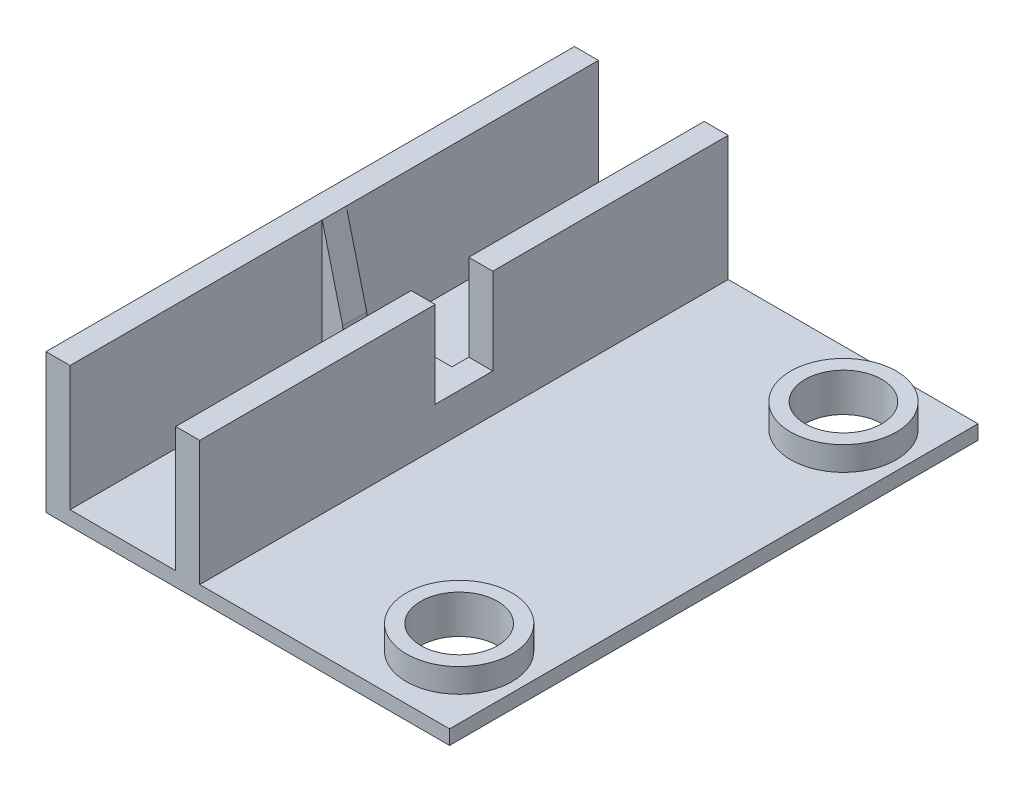
ISO-10303-21;
HEADER;
FILE_DESCRIPTION(('STEP AP214'),'2;1');
FILE_NAME('part.step','',(''),(''),'','','');
FILE_SCHEMA(('AUTOMOTIVE_DESIGN { 1 0 10303 214 1 1 1 1 }'));
ENDSEC;
DATA;
#1=APPLICATION_CONTEXT('core data for automotive mechanical design processes');
#2=APPLICATION_PROTOCOL_DEFINITION('international standard','automotive_design',2000,#1);
#3=PRODUCT_CONTEXT('',#1,'mechanical');
#4=PRODUCT('Part','Part','',(#3));
#5=PRODUCT_RELATED_PRODUCT_CATEGORY('part','',(#4));
#6=PRODUCT_DEFINITION_FORMATION('','',#4);
#7=PRODUCT_DEFINITION_CONTEXT('part definition',#1,'design');
#8=PRODUCT_DEFINITION('design','',#6,#7);
#9=PRODUCT_DEFINITION_SHAPE('','',#8);
#10=(LENGTH_UNIT() NAMED_UNIT(*) SI_UNIT(.MILLI.,.METRE.));
#11=(NAMED_UNIT(*) PLANE_ANGLE_UNIT() SI_UNIT($,.RADIAN.));
#12=(NAMED_UNIT(*) SI_UNIT($,.STERADIAN.) SOLID_ANGLE_UNIT());
#13=UNCERTAINTY_MEASURE_WITH_UNIT(LENGTH_MEASURE(1.E-05),#10,'distance_accuracy_value','');
#14=(GEOMETRIC_REPRESENTATION_CONTEXT(3) GLOBAL_UNCERTAINTY_ASSIGNED_CONTEXT((#13)) GLOBAL_UNIT_ASSIGNED_CONTEXT((#10,
#11,#12)) REPRESENTATION_CONTEXT('',''));
#15=CARTESIAN_POINT('',(0.,0.,0.));
#16=DIRECTION('',(0.,0.,1.));
#17=DIRECTION('',(1.,0.,0.));
#18=AXIS2_PLACEMENT_3D('',#15,#16,#17);
#19=CARTESIAN_POINT('',(-21.,14.5,48.1155281280883));
#20=DIRECTION('',(0.,-1.,0.));
#21=DIRECTION('',(0.,0.,-1.));
#22=AXIS2_PLACEMENT_3D('',#19,#20,#21);
#23=PLANE('',#22);
#24=DIRECTION('',(0.,0.,-1.));
#25=VECTOR('',#24,1.);
#26=CARTESIAN_POINT('',(-5.,14.5,48.1155281280883));
#27=LINE('',#26,#25);
#28=CARTESIAN_POINT('',(-5.,14.5,27.5));
#29=VERTEX_POINT('',#28);
#30=CARTESIAN_POINT('',(-5.,14.5,3.));
#31=VERTEX_POINT('',#30);
#32=EDGE_CURVE('E302',#29,#31,#27,.T.);
#33=ORIENTED_EDGE('',*,*,#32,.T.);
#34=DIRECTION('',(1.,0.,0.));
#35=VECTOR('',#34,1.);
#36=CARTESIAN_POINT('',(-11.5,14.5,3.));
#37=LINE('',#36,#35);
#38=CARTESIAN_POINT('',(-7.5,14.5,3.));
#39=VERTEX_POINT('',#38);
#40=EDGE_CURVE('E203',#39,#31,#37,.T.);
#41=ORIENTED_EDGE('',*,*,#40,.F.);
#42=DIRECTION('',(0.,0.,1.));
#43=VECTOR('',#42,1.);
#44=CARTESIAN_POINT('',(-7.5,14.5,-27.5));
#45=LINE('',#44,#43);
#46=CARTESIAN_POINT('',(-7.5,14.5,27.5));
#47=VERTEX_POINT('',#46);
#48=EDGE_CURVE('E281',#39,#47,#45,.T.);
#49=ORIENTED_EDGE('',*,*,#48,.T.);
#50=DIRECTION('',(1.,0.,0.));
#51=VECTOR('',#50,1.);
#52=CARTESIAN_POINT('',(-21.,14.5,27.5));
#53=LINE('',#52,#51);
#54=EDGE_CURVE('E306',#47,#29,#53,.T.);
#55=ORIENTED_EDGE('',*,*,#54,.T.);
#56=EDGE_LOOP('',(#33,#41,#49,#55));
#57=FACE_BOUND('',#56,.T.);
#58=ADVANCED_FACE('F47',(#57),#23,.F.);
#59=CARTESIAN_POINT('',(-7.5,14.5,-27.5));
#60=VERTEX_POINT('',#59);
#61=CARTESIAN_POINT('',(-7.5,14.5,-3.));
#62=VERTEX_POINT('',#61);
#63=EDGE_CURVE('E278',#60,#62,#45,.T.);
#64=ORIENTED_EDGE('',*,*,#63,.T.);
#65=DIRECTION('',(1.,0.,0.));
#66=VECTOR('',#65,1.);
#67=CARTESIAN_POINT('',(-11.5,14.5,-3.));
#68=LINE('',#67,#66);
#69=CARTESIAN_POINT('',(-5.,14.5,-3.));
#70=VERTEX_POINT('',#69);
#71=EDGE_CURVE('E216',#62,#70,#68,.T.);
#72=ORIENTED_EDGE('',*,*,#71,.T.);
#73=CARTESIAN_POINT('',(-5.,14.5,-27.5));
#74=VERTEX_POINT('',#73);
#75=EDGE_CURVE('E301',#70,#74,#27,.T.);
#76=ORIENTED_EDGE('',*,*,#75,.T.);
#77=DIRECTION('',(1.,0.,0.));
#78=VECTOR('',#77,1.);
#79=CARTESIAN_POINT('',(-21.,14.5,-27.5));
#80=LINE('',#79,#78);
#81=EDGE_CURVE('E290',#60,#74,#80,.T.);
#82=ORIENTED_EDGE('',*,*,#81,.F.);
#83=EDGE_LOOP('',(#64,#72,#76,#82));
#84=FACE_BOUND('',#83,.T.);
#85=ADVANCED_FACE('F429',(#84),#23,.F.);
#86=CARTESIAN_POINT('',(-18.5,14.5,-27.5));
#87=DIRECTION('',(-1.,0.,0.));
#88=DIRECTION('',(0.,0.,1.));
#89=AXIS2_PLACEMENT_3D('',#86,#87,#88);
#90=PLANE('',#89);
#91=DIRECTION('',(0.,1.,0.));
#92=VECTOR('',#91,1.);
#93=CARTESIAN_POINT('',(-18.5,14.5,-1.25));
#94=LINE('',#93,#92);
#95=CARTESIAN_POINT('',(-18.5,1.5,-1.25));
#96=VERTEX_POINT('',#95);
#97=CARTESIAN_POINT('',(-18.5,14.5,-1.25));
#98=VERTEX_POINT('',#97);
#99=EDGE_CURVE('E246',#96,#98,#94,.T.);
#100=ORIENTED_EDGE('',*,*,#99,.F.);
#101=DIRECTION('',(0.,0.,1.));
#102=VECTOR('',#101,1.);
#103=CARTESIAN_POINT('',(-18.5,1.5,-27.5));
#104=LINE('',#103,#102);
#105=CARTESIAN_POINT('',(-18.5,1.5,-27.5));
#106=VERTEX_POINT('',#105);
#107=EDGE_CURVE('E286',#106,#96,#104,.T.);
#108=ORIENTED_EDGE('',*,*,#107,.F.);
#109=DIRECTION('',(0.,-1.,0.));
#110=VECTOR('',#109,1.);
#111=CARTESIAN_POINT('',(-18.5,14.5,-27.5));
#112=LINE('',#111,#110);
#113=CARTESIAN_POINT('',(-18.5,14.5,-27.5));
#114=VERTEX_POINT('',#113);
#115=EDGE_CURVE('E255',#114,#106,#112,.T.);
#116=ORIENTED_EDGE('',*,*,#115,.F.);
#117=DIRECTION('',(0.,0.,1.));
#118=VECTOR('',#117,1.);
#119=CARTESIAN_POINT('',(-18.5,14.5,-27.5));
#120=LINE('',#119,#118);
#121=EDGE_CURVE('E273',#114,#98,#120,.T.);
#122=ORIENTED_EDGE('',*,*,#121,.T.);
#123=EDGE_LOOP('',(#100,#108,#116,#122));
#124=FACE_BOUND('',#123,.T.);
#125=ADVANCED_FACE('F434',(#124),#90,.F.);
#126=CARTESIAN_POINT('',(-7.5,14.5,-27.5));
#127=DIRECTION('',(1.,0.,0.));
#128=DIRECTION('',(0.,1.,0.));
#129=AXIS2_PLACEMENT_3D('',#126,#127,#128);
#130=PLANE('',#129);
#131=DIRECTION('',(0.,0.,-1.));
#132=VECTOR('',#131,1.);
#133=CARTESIAN_POINT('',(-7.5,5.5,-27.5));
#134=LINE('',#133,#132);
#135=CARTESIAN_POINT('',(-7.5,5.5,-1.25));
#136=VERTEX_POINT('',#135);
#137=CARTESIAN_POINT('',(-7.5,5.5,-3.));
#138=VERTEX_POINT('',#137);
#139=EDGE_CURVE('E224',#136,#138,#134,.T.);
#140=ORIENTED_EDGE('',*,*,#139,.T.);
#141=DIRECTION('',(0.,1.,0.));
#142=VECTOR('',#141,1.);
#143=CARTESIAN_POINT('',(-7.5,14.5,-3.));
#144=LINE('',#143,#142);
#145=EDGE_CURVE('E227',#138,#62,#144,.T.);
#146=ORIENTED_EDGE('',*,*,#145,.T.);
#147=ORIENTED_EDGE('',*,*,#63,.F.);
#148=DIRECTION('',(0.,1.,0.));
#149=VECTOR('',#148,1.);
#150=CARTESIAN_POINT('',(-7.5,14.5,-27.5));
#151=LINE('',#150,#149);
#152=CARTESIAN_POINT('',(-7.5,1.5,-27.5));
#153=VERTEX_POINT('',#152);
#154=EDGE_CURVE('E262',#153,#60,#151,.T.);
#155=ORIENTED_EDGE('',*,*,#154,.F.);
#156=DIRECTION('',(0.,0.,1.));
#157=VECTOR('',#156,1.);
#158=CARTESIAN_POINT('',(-7.5,1.5,-27.5));
#159=LINE('',#158,#157);
#160=CARTESIAN_POINT('',(-7.5,1.5,-1.25));
#161=VERTEX_POINT('',#160);
#162=EDGE_CURVE('E282',#153,#161,#159,.T.);
#163=ORIENTED_EDGE('',*,*,#162,.T.);
#164=DIRECTION('',(0.,-1.,0.));
#165=VECTOR('',#164,1.);
#166=CARTESIAN_POINT('',(-7.5,14.5,-1.25));
#167=LINE('',#166,#165);
#168=EDGE_CURVE('E243',#136,#161,#167,.T.);
#169=ORIENTED_EDGE('',*,*,#168,.F.);
#170=EDGE_LOOP('',(#140,#146,#147,#155,#163,#169));
#171=FACE_BOUND('',#170,.T.);
#172=ADVANCED_FACE('F474',(#171),#130,.F.);
#173=CARTESIAN_POINT('',(-18.5,1.5,-27.5));
#174=DIRECTION('',(0.,-1.,0.));
#175=DIRECTION('',(0.,0.,-1.));
#176=AXIS2_PLACEMENT_3D('',#173,#174,#175);
#177=PLANE('',#176);
#178=DIRECTION('',(-1.,0.,0.));
#179=VECTOR('',#178,1.);
#180=CARTESIAN_POINT('',(-18.5,1.5,-1.25));
#181=LINE('',#180,#179);
#182=EDGE_CURVE('E337',#161,#96,#181,.T.);
#183=ORIENTED_EDGE('',*,*,#182,.F.);
#184=ORIENTED_EDGE('',*,*,#162,.F.);
#185=DIRECTION('',(1.,0.,0.));
#186=VECTOR('',#185,1.);
#187=CARTESIAN_POINT('',(-18.5,1.5,-27.5));
#188=LINE('',#187,#186);
#189=EDGE_CURVE('E258',#106,#153,#188,.T.);
#190=ORIENTED_EDGE('',*,*,#189,.F.);
#191=ORIENTED_EDGE('',*,*,#107,.T.);
#192=EDGE_LOOP('',(#183,#184,#190,#191));
#193=FACE_BOUND('',#192,.T.);
#194=ADVANCED_FACE('F377',(#193),#177,.F.);
#195=CARTESIAN_POINT('',(0.,1.5,0.));
#196=DIRECTION('',(0.,-1.,0.));
#197=DIRECTION('',(0.,0.,-1.));
#198=AXIS2_PLACEMENT_3D('',#195,#196,#197);
#199=PLANE('',#198);
#200=CARTESIAN_POINT('',(14.5,1.5,20.));
#201=DIRECTION('',(0.,-1.,0.));
#202=DIRECTION('',(0.,0.,-1.));
#203=AXIS2_PLACEMENT_3D('',#200,#201,#202);
#204=CIRCLE('',#203,5.5);
#205=CARTESIAN_POINT('',(14.5,1.5,14.5));
#206=VERTEX_POINT('',#205);
#207=EDGE_CURVE('E353',#206,#206,#204,.T.);
#208=ORIENTED_EDGE('',*,*,#207,.T.);
#209=EDGE_LOOP('',(#208));
#210=FACE_BOUND('',#209,.T.);
#211=CARTESIAN_POINT('',(14.5,1.5,-20.));
#212=DIRECTION('',(0.,-1.,0.));
#213=DIRECTION('',(0.,0.,-1.));
#214=AXIS2_PLACEMENT_3D('',#211,#212,#213);
#215=CIRCLE('',#214,5.5);
#216=CARTESIAN_POINT('',(14.5,1.5,-25.5));
#217=VERTEX_POINT('',#216);
#218=EDGE_CURVE('E12',#217,#217,#215,.F.);
#219=ORIENTED_EDGE('',*,*,#218,.F.);
#220=EDGE_LOOP('',(#219));
#221=FACE_BOUND('',#220,.T.);
#222=DIRECTION('',(0.,0.,-1.));
#223=VECTOR('',#222,1.);
#224=CARTESIAN_POINT('',(-5.,1.5,48.1155281280883));
#225=LINE('',#224,#223);
#226=CARTESIAN_POINT('',(-5.,1.5,27.5));
#227=VERTEX_POINT('',#226);
#228=CARTESIAN_POINT('',(-5.,1.5,-27.5));
#229=VERTEX_POINT('',#228);
#230=EDGE_CURVE('E304',#227,#229,#225,.T.);
#231=ORIENTED_EDGE('',*,*,#230,.F.);
#232=DIRECTION('',(1.,0.,0.));
#233=VECTOR('',#232,1.);
#234=CARTESIAN_POINT('',(-21.,1.5,27.5));
#235=LINE('',#234,#233);
#236=CARTESIAN_POINT('',(21.,1.5,27.5));
#237=VERTEX_POINT('',#236);
#238=EDGE_CURVE('E316',#227,#237,#235,.T.);
#239=ORIENTED_EDGE('',*,*,#238,.T.);
#240=DIRECTION('',(0.,0.,-1.));
#241=VECTOR('',#240,1.);
#242=CARTESIAN_POINT('',(21.,1.5,27.5));
#243=LINE('',#242,#241);
#244=CARTESIAN_POINT('',(21.,1.5,-27.5));
#245=VERTEX_POINT('',#244);
#246=EDGE_CURVE('E309',#237,#245,#243,.T.);
#247=ORIENTED_EDGE('',*,*,#246,.T.);
#248=DIRECTION('',(-1.,0.,0.));
#249=VECTOR('',#248,1.);
#250=CARTESIAN_POINT('',(-21.,1.5,-27.5));
#251=LINE('',#250,#249);
#252=EDGE_CURVE('E312',#245,#229,#251,.T.);
#253=ORIENTED_EDGE('',*,*,#252,.T.);
#254=EDGE_LOOP('',(#231,#239,#247,#253));
#255=FACE_BOUND('',#254,.T.);
#256=ADVANCED_FACE('F374',(#210,#221,#255),#199,.F.);
#257=CARTESIAN_POINT('',(21.,1.5,27.5));
#258=DIRECTION('',(-1.,0.,0.));
#259=DIRECTION('',(0.,0.,1.));
#260=AXIS2_PLACEMENT_3D('',#257,#258,#259);
#261=PLANE('',#260);
#262=DIRECTION('',(0.,0.,-1.));
#263=VECTOR('',#262,1.);
#264=CARTESIAN_POINT('',(21.,0.,27.5));
#265=LINE('',#264,#263);
#266=CARTESIAN_POINT('',(21.,0.,27.5));
#267=VERTEX_POINT('',#266);
#268=CARTESIAN_POINT('',(21.,0.,-27.5));
#269=VERTEX_POINT('',#268);
#270=EDGE_CURVE('E298',#267,#269,#265,.T.);
#271=ORIENTED_EDGE('',*,*,#270,.T.);
#272=DIRECTION('',(0.,-1.,0.));
#273=VECTOR('',#272,1.);
#274=CARTESIAN_POINT('',(21.,1.5,-27.5));
#275=LINE('',#274,#273);
#276=EDGE_CURVE('E334',#245,#269,#275,.T.);
#277=ORIENTED_EDGE('',*,*,#276,.F.);
#278=ORIENTED_EDGE('',*,*,#246,.F.);
#279=DIRECTION('',(0.,-1.,0.));
#280=VECTOR('',#279,1.);
#281=CARTESIAN_POINT('',(21.,1.5,27.5));
#282=LINE('',#281,#280);
#283=EDGE_CURVE('E318',#237,#267,#282,.T.);
#284=ORIENTED_EDGE('',*,*,#283,.T.);
#285=EDGE_LOOP('',(#271,#277,#278,#284));
#286=FACE_BOUND('',#285,.T.);
#287=ADVANCED_FACE('F49',(#286),#261,.F.);
#288=CARTESIAN_POINT('',(-21.,1.5,-27.5));
#289=DIRECTION('',(0.,0.,1.));
#290=DIRECTION('',(1.,0.,0.));
#291=AXIS2_PLACEMENT_3D('',#288,#289,#290);
#292=PLANE('',#291);
#293=CARTESIAN_POINT('',(-21.,14.5,-27.5));
#294=VERTEX_POINT('',#293);
#295=EDGE_CURVE('E291',#294,#114,#80,.T.);
#296=ORIENTED_EDGE('',*,*,#295,.T.);
#297=ORIENTED_EDGE('',*,*,#115,.T.);
#298=ORIENTED_EDGE('',*,*,#189,.T.);
#299=ORIENTED_EDGE('',*,*,#154,.T.);
#300=ORIENTED_EDGE('',*,*,#81,.T.);
#301=DIRECTION('',(0.,-1.,0.));
#302=VECTOR('',#301,1.);
#303=CARTESIAN_POINT('',(-5.,1.5,-27.5));
#304=LINE('',#303,#302);
#305=EDGE_CURVE('E276',#74,#229,#304,.T.);
#306=ORIENTED_EDGE('',*,*,#305,.T.);
#307=ORIENTED_EDGE('',*,*,#252,.F.);
#308=ORIENTED_EDGE('',*,*,#276,.T.);
#309=DIRECTION('',(-1.,0.,0.));
#310=VECTOR('',#309,1.);
#311=CARTESIAN_POINT('',(-21.,0.,-27.5));
#312=LINE('',#311,#310);
#313=CARTESIAN_POINT('',(-21.,0.,-27.5));
#314=VERTEX_POINT('',#313);
#315=EDGE_CURVE('E321',#269,#314,#312,.T.);
#316=ORIENTED_EDGE('',*,*,#315,.T.);
#317=DIRECTION('',(0.,-1.,0.));
#318=VECTOR('',#317,1.);
#319=CARTESIAN_POINT('',(-21.,1.5,-27.5));
#320=LINE('',#319,#318);
#321=EDGE_CURVE('E331',#294,#314,#320,.T.);
#322=ORIENTED_EDGE('',*,*,#321,.F.);
#323=EDGE_LOOP('',(#296,#297,#298,#299,#300,#306,#307,#308,#316,#322));
#324=FACE_BOUND('',#323,.T.);
#325=ADVANCED_FACE('F417',(#324),#292,.F.);
#326=CARTESIAN_POINT('',(-21.,1.5,27.5));
#327=DIRECTION('',(1.,0.,0.));
#328=DIRECTION('',(0.,0.,-1.));
#329=AXIS2_PLACEMENT_3D('',#326,#327,#328);
#330=PLANE('',#329);
#331=DIRECTION('',(0.,0.,-1.));
#332=VECTOR('',#331,1.);
#333=CARTESIAN_POINT('',(-21.,14.5,48.1155281280883));
#334=LINE('',#333,#332);
#335=CARTESIAN_POINT('',(-21.,14.5,27.5));
#336=VERTEX_POINT('',#335);
#337=EDGE_CURVE('E294',#336,#294,#334,.T.);
#338=ORIENTED_EDGE('',*,*,#337,.T.);
#339=ORIENTED_EDGE('',*,*,#321,.T.);
#340=DIRECTION('',(0.,0.,1.));
#341=VECTOR('',#340,1.);
#342=CARTESIAN_POINT('',(-21.,0.,27.5));
#343=LINE('',#342,#341);
#344=CARTESIAN_POINT('',(-21.,0.,27.5));
#345=VERTEX_POINT('',#344);
#346=EDGE_CURVE('E323',#314,#345,#343,.T.);
#347=ORIENTED_EDGE('',*,*,#346,.T.);
#348=DIRECTION('',(0.,-1.,0.));
#349=VECTOR('',#348,1.);
#350=CARTESIAN_POINT('',(-21.,1.5,27.5));
#351=LINE('',#350,#349);
#352=EDGE_CURVE('E328',#336,#345,#351,.T.);
#353=ORIENTED_EDGE('',*,*,#352,.F.);
#354=EDGE_LOOP('',(#338,#339,#347,#353));
#355=FACE_BOUND('',#354,.T.);
#356=ADVANCED_FACE('F414',(#355),#330,.F.);
#357=CARTESIAN_POINT('',(-21.,1.5,27.5));
#358=DIRECTION('',(0.,0.,-1.));
#359=DIRECTION('',(-1.,0.,0.));
#360=AXIS2_PLACEMENT_3D('',#357,#358,#359);
#361=PLANE('',#360);
#362=DIRECTION('',(1.,0.,0.));
#363=VECTOR('',#362,1.);
#364=CARTESIAN_POINT('',(-18.5,1.5,27.5));
#365=LINE('',#364,#363);
#366=CARTESIAN_POINT('',(-18.5,1.5,27.5));
#367=VERTEX_POINT('',#366);
#368=CARTESIAN_POINT('',(-7.5,1.5,27.5));
#369=VERTEX_POINT('',#368);
#370=EDGE_CURVE('E268',#367,#369,#365,.T.);
#371=ORIENTED_EDGE('',*,*,#370,.F.);
#372=DIRECTION('',(0.,-1.,0.));
#373=VECTOR('',#372,1.);
#374=CARTESIAN_POINT('',(-18.5,14.5,27.5));
#375=LINE('',#374,#373);
#376=CARTESIAN_POINT('',(-18.5,14.5,27.5));
#377=VERTEX_POINT('',#376);
#378=EDGE_CURVE('E254',#377,#367,#375,.T.);
#379=ORIENTED_EDGE('',*,*,#378,.F.);
#380=EDGE_CURVE('E299',#336,#377,#53,.T.);
#381=ORIENTED_EDGE('',*,*,#380,.F.);
#382=ORIENTED_EDGE('',*,*,#352,.T.);
#383=DIRECTION('',(1.,0.,0.));
#384=VECTOR('',#383,1.);
#385=CARTESIAN_POINT('',(-21.,0.,27.5));
#386=LINE('',#385,#384);
#387=EDGE_CURVE('E313',#345,#267,#386,.T.);
#388=ORIENTED_EDGE('',*,*,#387,.T.);
#389=ORIENTED_EDGE('',*,*,#283,.F.);
#390=ORIENTED_EDGE('',*,*,#238,.F.);
#391=DIRECTION('',(0.,-1.,0.));
#392=VECTOR('',#391,1.);
#393=CARTESIAN_POINT('',(-5.,1.5,27.5));
#394=LINE('',#393,#392);
#395=EDGE_CURVE('E295',#29,#227,#394,.T.);
#396=ORIENTED_EDGE('',*,*,#395,.F.);
#397=ORIENTED_EDGE('',*,*,#54,.F.);
#398=DIRECTION('',(0.,1.,0.));
#399=VECTOR('',#398,1.);
#400=CARTESIAN_POINT('',(-7.5,14.5,27.5));
#401=LINE('',#400,#399);
#402=EDGE_CURVE('E259',#369,#47,#401,.T.);
#403=ORIENTED_EDGE('',*,*,#402,.F.);
#404=EDGE_LOOP('',(#371,#379,#381,#382,#388,#389,#390,#396,#397,#403));
#405=FACE_BOUND('',#404,.T.);
#406=ADVANCED_FACE('F386',(#405),#361,.F.);
#407=CARTESIAN_POINT('',(0.,0.,0.));
#408=DIRECTION('',(0.,-1.,0.));
#409=DIRECTION('',(0.,0.,-1.));
#410=AXIS2_PLACEMENT_3D('',#407,#408,#409);
#411=PLANE('',#410);
#412=CARTESIAN_POINT('',(14.5,0.,20.));
#413=DIRECTION('',(0.,-1.,0.));
#414=DIRECTION('',(0.,0.,-1.));
#415=AXIS2_PLACEMENT_3D('',#412,#413,#414);
#416=CIRCLE('',#415,4.);
#417=CARTESIAN_POINT('',(14.5,0.,16.));
#418=VERTEX_POINT('',#417);
#419=EDGE_CURVE('E51',#418,#418,#416,.F.);
#420=ORIENTED_EDGE('',*,*,#419,.T.);
#421=EDGE_LOOP('',(#420));
#422=FACE_BOUND('',#421,.T.);
#423=CARTESIAN_POINT('',(14.5,0.,-20.));
#424=DIRECTION('',(0.,-1.,0.));
#425=DIRECTION('',(0.,0.,-1.));
#426=AXIS2_PLACEMENT_3D('',#423,#424,#425);
#427=CIRCLE('',#426,4.);
#428=CARTESIAN_POINT('',(14.5,0.,-24.));
#429=VERTEX_POINT('',#428);
#430=EDGE_CURVE('E344',#429,#429,#427,.T.);
#431=ORIENTED_EDGE('',*,*,#430,.F.);
#432=EDGE_LOOP('',(#431));
#433=FACE_BOUND('',#432,.T.);
#434=ORIENTED_EDGE('',*,*,#270,.F.);
#435=ORIENTED_EDGE('',*,*,#387,.F.);
#436=ORIENTED_EDGE('',*,*,#346,.F.);
#437=ORIENTED_EDGE('',*,*,#315,.F.);
#438=EDGE_LOOP('',(#434,#435,#436,#437));
#439=FACE_BOUND('',#438,.T.);
#440=ADVANCED_FACE('F421',(#422,#433,#439),#411,.T.);
#441=CARTESIAN_POINT('',(-18.5,14.5,1.25));
#442=VERTEX_POINT('',#441);
#443=EDGE_CURVE('E277',#442,#377,#120,.T.);
#444=ORIENTED_EDGE('',*,*,#443,.F.);
#445=DIRECTION('',(0.,0.,1.));
#446=VECTOR('',#445,1.);
#447=CARTESIAN_POINT('',(-18.5,14.5,-1.25));
#448=LINE('',#447,#446);
#449=EDGE_CURVE('E236',#98,#442,#448,.T.);
#450=ORIENTED_EDGE('',*,*,#449,.F.);
#451=ORIENTED_EDGE('',*,*,#121,.F.);
#452=ORIENTED_EDGE('',*,*,#295,.F.);
#453=ORIENTED_EDGE('',*,*,#337,.F.);
#454=ORIENTED_EDGE('',*,*,#380,.T.);
#455=EDGE_LOOP('',(#444,#450,#451,#452,#453,#454));
#456=FACE_BOUND('',#455,.T.);
#457=ADVANCED_FACE('F408',(#456),#23,.F.);
#458=CARTESIAN_POINT('',(-5.,1.5,48.1155281280883));
#459=DIRECTION('',(-1.,0.,0.));
#460=DIRECTION('',(0.,0.,1.));
#461=AXIS2_PLACEMENT_3D('',#458,#459,#460);
#462=PLANE('',#461);
#463=DIRECTION('',(0.,0.,-1.));
#464=VECTOR('',#463,1.);
#465=CARTESIAN_POINT('',(-5.,5.5,3.));
#466=LINE('',#465,#464);
#467=CARTESIAN_POINT('',(-5.,5.5,3.));
#468=VERTEX_POINT('',#467);
#469=CARTESIAN_POINT('',(-5.,5.5,-3.));
#470=VERTEX_POINT('',#469);
#471=EDGE_CURVE('E190',#468,#470,#466,.T.);
#472=ORIENTED_EDGE('',*,*,#471,.F.);
#473=DIRECTION('',(0.,-1.,0.));
#474=VECTOR('',#473,1.);
#475=CARTESIAN_POINT('',(-5.,14.5,3.));
#476=LINE('',#475,#474);
#477=EDGE_CURVE('E200',#31,#468,#476,.T.);
#478=ORIENTED_EDGE('',*,*,#477,.F.);
#479=ORIENTED_EDGE('',*,*,#32,.F.);
#480=ORIENTED_EDGE('',*,*,#395,.T.);
#481=ORIENTED_EDGE('',*,*,#230,.T.);
#482=ORIENTED_EDGE('',*,*,#305,.F.);
#483=ORIENTED_EDGE('',*,*,#75,.F.);
#484=DIRECTION('',(0.,1.,0.));
#485=VECTOR('',#484,1.);
#486=CARTESIAN_POINT('',(-5.,14.5,-3.));
#487=LINE('',#486,#485);
#488=EDGE_CURVE('E197',#470,#70,#487,.T.);
#489=ORIENTED_EDGE('',*,*,#488,.F.);
#490=EDGE_LOOP('',(#472,#478,#479,#480,#481,#482,#483,#489));
#491=FACE_BOUND('',#490,.T.);
#492=ADVANCED_FACE('F209',(#491),#462,.F.);
#493=CARTESIAN_POINT('',(-18.5,1.5,1.25));
#494=VERTEX_POINT('',#493);
#495=EDGE_CURVE('E265',#494,#367,#104,.T.);
#496=ORIENTED_EDGE('',*,*,#495,.F.);
#497=DIRECTION('',(0.,1.,0.));
#498=VECTOR('',#497,1.);
#499=CARTESIAN_POINT('',(-18.5,14.5,1.25));
#500=LINE('',#499,#498);
#501=EDGE_CURVE('E251',#494,#442,#500,.T.);
#502=ORIENTED_EDGE('',*,*,#501,.T.);
#503=ORIENTED_EDGE('',*,*,#443,.T.);
#504=ORIENTED_EDGE('',*,*,#378,.T.);
#505=EDGE_LOOP('',(#496,#502,#503,#504));
#506=FACE_BOUND('',#505,.T.);
#507=ADVANCED_FACE('F403',(#506),#90,.F.);
#508=ORIENTED_EDGE('',*,*,#48,.F.);
#509=DIRECTION('',(0.,-1.,0.));
#510=VECTOR('',#509,1.);
#511=CARTESIAN_POINT('',(-7.5,14.5,3.));
#512=LINE('',#511,#510);
#513=CARTESIAN_POINT('',(-7.5,5.5,3.));
#514=VERTEX_POINT('',#513);
#515=EDGE_CURVE('E56',#39,#514,#512,.T.);
#516=ORIENTED_EDGE('',*,*,#515,.T.);
#517=DIRECTION('',(0.,0.,-1.));
#518=VECTOR('',#517,1.);
#519=CARTESIAN_POINT('',(-7.5,5.5,-27.5));
#520=LINE('',#519,#518);
#521=CARTESIAN_POINT('',(-7.5,5.5,1.25));
#522=VERTEX_POINT('',#521);
#523=EDGE_CURVE('E193',#514,#522,#520,.T.);
#524=ORIENTED_EDGE('',*,*,#523,.T.);
#525=DIRECTION('',(0.,-1.,0.));
#526=VECTOR('',#525,1.);
#527=CARTESIAN_POINT('',(-7.5,14.5,1.25));
#528=LINE('',#527,#526);
#529=CARTESIAN_POINT('',(-7.5,1.5,1.25));
#530=VERTEX_POINT('',#529);
#531=EDGE_CURVE('E249',#522,#530,#528,.T.);
#532=ORIENTED_EDGE('',*,*,#531,.T.);
#533=EDGE_CURVE('E285',#530,#369,#159,.T.);
#534=ORIENTED_EDGE('',*,*,#533,.T.);
#535=ORIENTED_EDGE('',*,*,#402,.T.);
#536=EDGE_LOOP('',(#508,#516,#524,#532,#534,#535));
#537=FACE_BOUND('',#536,.T.);
#538=ADVANCED_FACE('F394',(#537),#130,.F.);
#539=ORIENTED_EDGE('',*,*,#533,.F.);
#540=DIRECTION('',(-1.,0.,0.));
#541=VECTOR('',#540,1.);
#542=CARTESIAN_POINT('',(-18.5,1.5,1.25));
#543=LINE('',#542,#541);
#544=EDGE_CURVE('E340',#530,#494,#543,.T.);
#545=ORIENTED_EDGE('',*,*,#544,.T.);
#546=ORIENTED_EDGE('',*,*,#495,.T.);
#547=ORIENTED_EDGE('',*,*,#370,.T.);
#548=EDGE_LOOP('',(#539,#545,#546,#547));
#549=FACE_BOUND('',#548,.T.);
#550=ADVANCED_FACE('F399',(#549),#177,.F.);
#551=CARTESIAN_POINT('',(0.,0.,1.25));
#552=DIRECTION('',(0.,0.,1.));
#553=DIRECTION('',(1.,0.,0.));
#554=AXIS2_PLACEMENT_3D('',#551,#552,#553);
#555=PLANE('',#554);
#556=DIRECTION('',(1.,0.,0.));
#557=VECTOR('',#556,1.);
#558=CARTESIAN_POINT('',(0.,5.5,1.25));
#559=LINE('',#558,#557);
#560=CARTESIAN_POINT('',(-9.6655488633757,5.5,1.25));
#561=VERTEX_POINT('',#560);
#562=EDGE_CURVE('E221',#561,#522,#559,.T.);
#563=ORIENTED_EDGE('',*,*,#562,.F.);
#564=CARTESIAN_POINT('',(-13.,6.01043041359383,1.25));
#565=DIRECTION('',(0.,0.,1.));
#566=DIRECTION('',(1.,0.,0.));
#567=AXIS2_PLACEMENT_3D('',#564,#565,#566);
#568=CIRCLE('',#567,3.37329269255673);
#569=CARTESIAN_POINT('',(-16.3732926925567,6.01043041359383,1.25));
#570=VERTEX_POINT('',#569);
#571=EDGE_CURVE('E234',#570,#561,#568,.T.);
#572=ORIENTED_EDGE('',*,*,#571,.F.);
#573=DIRECTION('',(0.242999621633185,-0.970026383087661,0.));
#574=VECTOR('',#573,1.);
#575=CARTESIAN_POINT('',(-18.5,14.5,1.25));
#576=LINE('',#575,#574);
#577=EDGE_CURVE('E230',#442,#570,#576,.T.);
#578=ORIENTED_EDGE('',*,*,#577,.F.);
#579=ORIENTED_EDGE('',*,*,#501,.F.);
#580=ORIENTED_EDGE('',*,*,#544,.F.);
#581=ORIENTED_EDGE('',*,*,#531,.F.);
#582=EDGE_LOOP('',(#563,#572,#578,#579,#580,#581));
#583=FACE_BOUND('',#582,.T.);
#584=ADVANCED_FACE('F556',(#583),#555,.T.);
#585=CARTESIAN_POINT('',(0.,0.,-1.25));
#586=DIRECTION('',(0.,0.,1.));
#587=DIRECTION('',(1.,0.,0.));
#588=AXIS2_PLACEMENT_3D('',#585,#586,#587);
#589=PLANE('',#588);
#590=CARTESIAN_POINT('',(-13.,6.01043041359383,-1.25));
#591=DIRECTION('',(0.,0.,1.));
#592=DIRECTION('',(1.,0.,0.));
#593=AXIS2_PLACEMENT_3D('',#590,#591,#592);
#594=CIRCLE('',#593,3.37329269255673);
#595=CARTESIAN_POINT('',(-16.3732926925567,6.01043041359383,-1.25));
#596=VERTEX_POINT('',#595);
#597=CARTESIAN_POINT('',(-9.6655488633757,5.5,-1.25));
#598=VERTEX_POINT('',#597);
#599=EDGE_CURVE('E71',#596,#598,#594,.T.);
#600=ORIENTED_EDGE('',*,*,#599,.T.);
#601=DIRECTION('',(1.,0.,0.));
#602=VECTOR('',#601,1.);
#603=CARTESIAN_POINT('',(0.,5.5,-1.25));
#604=LINE('',#603,#602);
#605=EDGE_CURVE('E64',#598,#136,#604,.T.);
#606=ORIENTED_EDGE('',*,*,#605,.T.);
#607=ORIENTED_EDGE('',*,*,#168,.T.);
#608=ORIENTED_EDGE('',*,*,#182,.T.);
#609=ORIENTED_EDGE('',*,*,#99,.T.);
#610=DIRECTION('',(0.242999621633185,-0.970026383087661,0.));
#611=VECTOR('',#610,1.);
#612=CARTESIAN_POINT('',(-18.5,14.5,-1.25));
#613=LINE('',#612,#611);
#614=EDGE_CURVE('E231',#98,#596,#613,.T.);
#615=ORIENTED_EDGE('',*,*,#614,.T.);
#616=EDGE_LOOP('',(#600,#606,#607,#608,#609,#615));
#617=FACE_BOUND('',#616,.T.);
#618=ADVANCED_FACE('F552',(#617),#589,.F.);
#619=CARTESIAN_POINT('',(-13.,6.01043041359383,-1.25));
#620=DIRECTION('',(0.,0.,1.));
#621=DIRECTION('',(1.,0.,0.));
#622=AXIS2_PLACEMENT_3D('',#619,#620,#621);
#623=CYLINDRICAL_SURFACE('',#622,3.37329269255673);
#624=ORIENTED_EDGE('',*,*,#571,.T.);
#625=DIRECTION('',(0.,0.,1.));
#626=VECTOR('',#625,1.);
#627=CARTESIAN_POINT('',(-9.6655488633757,5.5,-1.25));
#628=LINE('',#627,#626);
#629=EDGE_CURVE('E342',#561,#598,#628,.F.);
#630=ORIENTED_EDGE('',*,*,#629,.T.);
#631=ORIENTED_EDGE('',*,*,#599,.F.);
#632=DIRECTION('',(0.,0.,1.));
#633=VECTOR('',#632,1.);
#634=CARTESIAN_POINT('',(-16.3732926925567,6.01043041359383,-1.25));
#635=LINE('',#634,#633);
#636=EDGE_CURVE('E241',#596,#570,#635,.T.);
#637=ORIENTED_EDGE('',*,*,#636,.T.);
#638=EDGE_LOOP('',(#624,#630,#631,#637));
#639=FACE_BOUND('',#638,.T.);
#640=ADVANCED_FACE('F549',(#639),#623,.F.);
#641=CARTESIAN_POINT('',(-18.5,14.5,-1.25));
#642=DIRECTION('',(-0.970026383087661,-0.242999621633185,0.));
#643=DIRECTION('',(0.242999621633185,-0.970026383087661,0.));
#644=AXIS2_PLACEMENT_3D('',#641,#642,#643);
#645=PLANE('',#644);
#646=ORIENTED_EDGE('',*,*,#577,.T.);
#647=ORIENTED_EDGE('',*,*,#636,.F.);
#648=ORIENTED_EDGE('',*,*,#614,.F.);
#649=ORIENTED_EDGE('',*,*,#449,.T.);
#650=EDGE_LOOP('',(#646,#647,#648,#649));
#651=FACE_BOUND('',#650,.T.);
#652=ADVANCED_FACE('F543',(#651),#645,.F.);
#653=CARTESIAN_POINT('',(-11.5,14.5,-3.));
#654=DIRECTION('',(0.,0.,-1.));
#655=DIRECTION('',(0.,1.,0.));
#656=AXIS2_PLACEMENT_3D('',#653,#654,#655);
#657=PLANE('',#656);
#658=DIRECTION('',(1.,0.,0.));
#659=VECTOR('',#658,1.);
#660=CARTESIAN_POINT('',(-11.5,5.5,-3.));
#661=LINE('',#660,#659);
#662=EDGE_CURVE('E196',#138,#470,#661,.T.);
#663=ORIENTED_EDGE('',*,*,#662,.T.);
#664=ORIENTED_EDGE('',*,*,#488,.T.);
#665=ORIENTED_EDGE('',*,*,#71,.F.);
#666=ORIENTED_EDGE('',*,*,#145,.F.);
#667=EDGE_LOOP('',(#663,#664,#665,#666));
#668=FACE_BOUND('',#667,.T.);
#669=ADVANCED_FACE('F540',(#668),#657,.F.);
#670=CARTESIAN_POINT('',(-11.5,14.5,3.));
#671=DIRECTION('',(0.,0.,1.));
#672=DIRECTION('',(0.,-1.,0.));
#673=AXIS2_PLACEMENT_3D('',#670,#671,#672);
#674=PLANE('',#673);
#675=ORIENTED_EDGE('',*,*,#40,.T.);
#676=ORIENTED_EDGE('',*,*,#477,.T.);
#677=DIRECTION('',(1.,0.,0.));
#678=VECTOR('',#677,1.);
#679=CARTESIAN_POINT('',(-11.5,5.5,3.));
#680=LINE('',#679,#678);
#681=EDGE_CURVE('E185',#514,#468,#680,.T.);
#682=ORIENTED_EDGE('',*,*,#681,.F.);
#683=ORIENTED_EDGE('',*,*,#515,.F.);
#684=EDGE_LOOP('',(#675,#676,#682,#683));
#685=FACE_BOUND('',#684,.T.);
#686=ADVANCED_FACE('F201',(#685),#674,.F.);
#687=CARTESIAN_POINT('',(-11.5,5.5,3.));
#688=DIRECTION('',(0.,-1.,0.));
#689=DIRECTION('',(0.,0.,-1.));
#690=AXIS2_PLACEMENT_3D('',#687,#688,#689);
#691=PLANE('',#690);
#692=ORIENTED_EDGE('',*,*,#605,.F.);
#693=ORIENTED_EDGE('',*,*,#629,.F.);
#694=ORIENTED_EDGE('',*,*,#562,.T.);
#695=ORIENTED_EDGE('',*,*,#523,.F.);
#696=ORIENTED_EDGE('',*,*,#681,.T.);
#697=ORIENTED_EDGE('',*,*,#471,.T.);
#698=ORIENTED_EDGE('',*,*,#662,.F.);
#699=ORIENTED_EDGE('',*,*,#139,.F.);
#700=EDGE_LOOP('',(#692,#693,#694,#695,#696,#697,#698,#699));
#701=FACE_BOUND('',#700,.T.);
#702=ADVANCED_FACE('F187',(#701),#691,.F.);
#703=CARTESIAN_POINT('',(14.5,4.,-20.));
#704=DIRECTION('',(0.,1.,0.));
#705=DIRECTION('',(0.,0.,1.));
#706=AXIS2_PLACEMENT_3D('',#703,#704,#705);
#707=PLANE('',#706);
#708=CARTESIAN_POINT('',(14.5,4.,-20.));
#709=DIRECTION('',(0.,1.,0.));
#710=DIRECTION('',(0.,0.,1.));
#711=AXIS2_PLACEMENT_3D('',#708,#709,#710);
#712=CIRCLE('',#711,5.5);
#713=CARTESIAN_POINT('',(14.5,4.,-14.5));
#714=VERTEX_POINT('',#713);
#715=EDGE_CURVE('E207',#714,#714,#712,.T.);
#716=ORIENTED_EDGE('',*,*,#715,.T.);
#717=EDGE_LOOP('',(#716));
#718=FACE_BOUND('',#717,.T.);
#719=CARTESIAN_POINT('',(14.5,4.,-20.));
#720=DIRECTION('',(0.,1.,0.));
#721=DIRECTION('',(0.,0.,1.));
#722=AXIS2_PLACEMENT_3D('',#719,#720,#721);
#723=CIRCLE('',#722,4.);
#724=CARTESIAN_POINT('',(14.5,4.,-16.));
#725=VERTEX_POINT('',#724);
#726=EDGE_CURVE('E346',#725,#725,#723,.T.);
#727=ORIENTED_EDGE('',*,*,#726,.F.);
#728=EDGE_LOOP('',(#727));
#729=FACE_BOUND('',#728,.T.);
#730=ADVANCED_FACE('F364',(#718,#729),#707,.T.);
#731=CARTESIAN_POINT('',(14.5,4.,-20.));
#732=DIRECTION('',(0.,-1.,0.));
#733=DIRECTION('',(0.,0.,-1.));
#734=AXIS2_PLACEMENT_3D('',#731,#732,#733);
#735=CYLINDRICAL_SURFACE('',#734,5.5);
#736=ORIENTED_EDGE('',*,*,#715,.F.);
#737=EDGE_LOOP('',(#736));
#738=FACE_BOUND('',#737,.T.);
#739=ORIENTED_EDGE('',*,*,#218,.T.);
#740=EDGE_LOOP('',(#739));
#741=FACE_BOUND('',#740,.T.);
#742=ADVANCED_FACE('F367',(#738,#741),#735,.T.);
#743=CARTESIAN_POINT('',(14.5,4.,-20.));
#744=DIRECTION('',(0.,-1.,0.));
#745=DIRECTION('',(0.,0.,-1.));
#746=AXIS2_PLACEMENT_3D('',#743,#744,#745);
#747=CYLINDRICAL_SURFACE('',#746,4.);
#748=ORIENTED_EDGE('',*,*,#726,.T.);
#749=EDGE_LOOP('',(#748));
#750=FACE_BOUND('',#749,.T.);
#751=ORIENTED_EDGE('',*,*,#430,.T.);
#752=EDGE_LOOP('',(#751));
#753=FACE_BOUND('',#752,.T.);
#754=ADVANCED_FACE('F370',(#750,#753),#747,.F.);
#755=CARTESIAN_POINT('',(14.5,4.,20.));
#756=DIRECTION('',(0.,-1.,0.));
#757=DIRECTION('',(0.,0.,-1.));
#758=AXIS2_PLACEMENT_3D('',#755,#756,#757);
#759=CYLINDRICAL_SURFACE('',#758,5.5);
#760=CARTESIAN_POINT('',(14.5,4.,20.));
#761=DIRECTION('',(0.,-1.,0.));
#762=DIRECTION('',(0.,0.,-1.));
#763=AXIS2_PLACEMENT_3D('',#760,#761,#762);
#764=CIRCLE('',#763,5.5);
#765=CARTESIAN_POINT('',(14.5,4.,14.5));
#766=VERTEX_POINT('',#765);
#767=EDGE_CURVE('E347',#766,#766,#764,.T.);
#768=ORIENTED_EDGE('',*,*,#767,.T.);
#769=EDGE_LOOP('',(#768));
#770=FACE_BOUND('',#769,.T.);
#771=ORIENTED_EDGE('',*,*,#207,.F.);
#772=EDGE_LOOP('',(#771));
#773=FACE_BOUND('',#772,.T.);
#774=ADVANCED_FACE('F502',(#770,#773),#759,.T.);
#775=CARTESIAN_POINT('',(14.5,4.,20.));
#776=DIRECTION('',(0.,1.,0.));
#777=DIRECTION('',(0.,0.,-1.));
#778=AXIS2_PLACEMENT_3D('',#775,#776,#777);
#779=PLANE('',#778);
#780=CARTESIAN_POINT('',(14.5,4.,20.));
#781=DIRECTION('',(0.,-1.,0.));
#782=DIRECTION('',(0.,0.,-1.));
#783=AXIS2_PLACEMENT_3D('',#780,#781,#782);
#784=CIRCLE('',#783,4.);
#785=CARTESIAN_POINT('',(14.5,4.,16.));
#786=VERTEX_POINT('',#785);
#787=EDGE_CURVE('E358',#786,#786,#784,.T.);
#788=ORIENTED_EDGE('',*,*,#787,.T.);
#789=EDGE_LOOP('',(#788));
#790=FACE_BOUND('',#789,.T.);
#791=ORIENTED_EDGE('',*,*,#767,.F.);
#792=EDGE_LOOP('',(#791));
#793=FACE_BOUND('',#792,.T.);
#794=ADVANCED_FACE('F507',(#790,#793),#779,.T.);
#795=CARTESIAN_POINT('',(14.5,4.,20.));
#796=DIRECTION('',(0.,-1.,0.));
#797=DIRECTION('',(0.,0.,-1.));
#798=AXIS2_PLACEMENT_3D('',#795,#796,#797);
#799=CYLINDRICAL_SURFACE('',#798,4.);
#800=ORIENTED_EDGE('',*,*,#787,.F.);
#801=EDGE_LOOP('',(#800));
#802=FACE_BOUND('',#801,.T.);
#803=ORIENTED_EDGE('',*,*,#419,.F.);
#804=EDGE_LOOP('',(#803));
#805=FACE_BOUND('',#804,.T.);
#806=ADVANCED_FACE('F516',(#802,#805),#799,.F.);
#807=CLOSED_SHELL('',(#58,#85,#125,#172,#194,#256,#287,#325,#356,#406,#440,#457,#492,#507,#538,
#550,#584,#618,#640,#652,#669,#686,#702,#730,#742,#754,#774,#794,#806));
#808=MANIFOLD_SOLID_BREP('B2',#807);
#809=ADVANCED_BREP_SHAPE_REPRESENTATION('',(#18,#808),#14);
#810=SHAPE_DEFINITION_REPRESENTATION(#9,#809);
ENDSEC;
END-ISO-10303-21;
